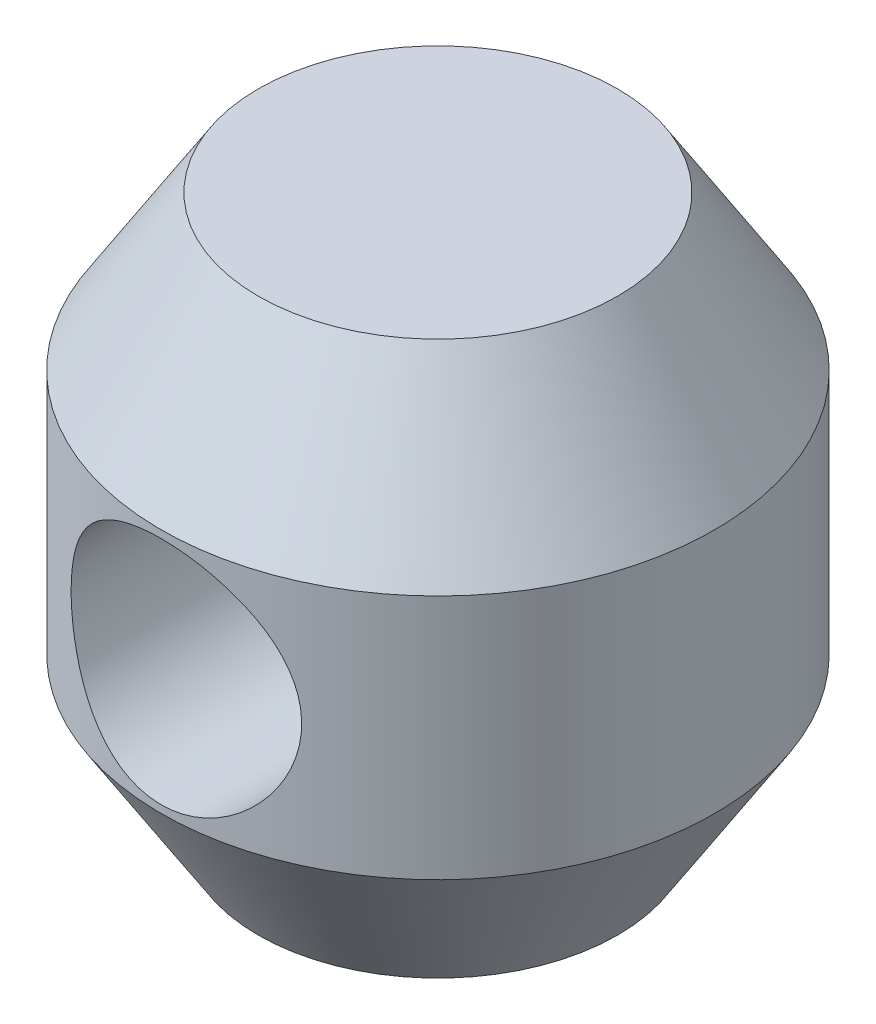
ISO-10303-21;
HEADER;
FILE_DESCRIPTION(('STEP AP214'),'2;1');
FILE_NAME('part.step','',(''),(''),'','','');
FILE_SCHEMA(('AUTOMOTIVE_DESIGN { 1 0 10303 214 1 1 1 1 }'));
ENDSEC;
DATA;
#1=APPLICATION_CONTEXT('core data for automotive mechanical design processes');
#2=APPLICATION_PROTOCOL_DEFINITION('international standard','automotive_design',2000,#1);
#3=PRODUCT_CONTEXT('',#1,'mechanical');
#4=PRODUCT('Part','Part','',(#3));
#5=PRODUCT_RELATED_PRODUCT_CATEGORY('part','',(#4));
#6=PRODUCT_DEFINITION_FORMATION('','',#4);
#7=PRODUCT_DEFINITION_CONTEXT('part definition',#1,'design');
#8=PRODUCT_DEFINITION('design','',#6,#7);
#9=PRODUCT_DEFINITION_SHAPE('','',#8);
#10=(LENGTH_UNIT() NAMED_UNIT(*) SI_UNIT(.MILLI.,.METRE.));
#11=(NAMED_UNIT(*) PLANE_ANGLE_UNIT() SI_UNIT($,.RADIAN.));
#12=(NAMED_UNIT(*) SI_UNIT($,.STERADIAN.) SOLID_ANGLE_UNIT());
#13=UNCERTAINTY_MEASURE_WITH_UNIT(LENGTH_MEASURE(1.E-05),#10,'distance_accuracy_value','');
#14=(GEOMETRIC_REPRESENTATION_CONTEXT(3) GLOBAL_UNCERTAINTY_ASSIGNED_CONTEXT((#13)) GLOBAL_UNIT_ASSIGNED_CONTEXT((#10,
#11,#12)) REPRESENTATION_CONTEXT('',''));
#15=CARTESIAN_POINT('',(0.,0.,0.));
#16=DIRECTION('',(0.,0.,1.));
#17=DIRECTION('',(1.,0.,0.));
#18=AXIS2_PLACEMENT_3D('',#15,#16,#17);
#19=CARTESIAN_POINT('',(6.18428062224485,9.525,0.));
#20=DIRECTION('',(0.,-1.,0.));
#21=DIRECTION('',(1.,0.,0.));
#22=AXIS2_PLACEMENT_3D('',#19,#20,#21);
#23=PLANE('',#22);
#24=CARTESIAN_POINT('',(0.,9.525,0.));
#25=DIRECTION('',(0.,1.,0.));
#26=DIRECTION('',(-1.,0.,0.));
#27=AXIS2_PLACEMENT_3D('',#24,#25,#26);
#28=CIRCLE('',#27,6.18428062224485);
#29=CARTESIAN_POINT('',(-6.18428062224484,9.525,0.));
#30=VERTEX_POINT('',#29);
#31=EDGE_CURVE('E45',#30,#30,#28,.T.);
#32=ORIENTED_EDGE('',*,*,#31,.T.);
#33=EDGE_LOOP('',(#32));
#34=FACE_BOUND('',#33,.T.);
#35=ADVANCED_FACE('F30',(#34),#23,.F.);
#36=CARTESIAN_POINT('',(0.,4.22956157153226,0.));
#37=DIRECTION('',(0.,-1.,0.));
#38=DIRECTION('',(1.,0.,0.));
#39=AXIS2_PLACEMENT_3D('',#36,#37,#38);
#40=CONICAL_SURFACE('',#39,9.525,0.562807434488238);
#41=ORIENTED_EDGE('',*,*,#31,.F.);
#42=EDGE_LOOP('',(#41));
#43=FACE_BOUND('',#42,.T.);
#44=CARTESIAN_POINT('',(0.,4.22956157153226,0.));
#45=DIRECTION('',(0.,1.,0.));
#46=DIRECTION('',(-1.,0.,0.));
#47=AXIS2_PLACEMENT_3D('',#44,#45,#46);
#48=CIRCLE('',#47,9.525);
#49=CARTESIAN_POINT('',(-9.52499999999999,4.22956157153226,0.));
#50=VERTEX_POINT('',#49);
#51=EDGE_CURVE('E49',#50,#50,#48,.T.);
#52=ORIENTED_EDGE('',*,*,#51,.T.);
#53=EDGE_LOOP('',(#52));
#54=FACE_BOUND('',#53,.T.);
#55=ADVANCED_FACE('F73',(#43,#54),#40,.T.);
#56=CARTESIAN_POINT('',(0.,20.8294252873563,0.));
#57=DIRECTION('',(0.,1.,0.));
#58=DIRECTION('',(-1.,0.,0.));
#59=AXIS2_PLACEMENT_3D('',#56,#57,#58);
#60=CYLINDRICAL_SURFACE('',#59,9.525);
#61=CARTESIAN_POINT('',(0.,3.96875,9.525));
#62=CARTESIAN_POINT('',(0.106339704110794,3.96874924420082,9.52499940431025));
#63=CARTESIAN_POINT('',(0.212715681361913,3.96447001336336,9.52321418687749));
#64=CARTESIAN_POINT('',(0.42470860687925,3.94739427644123,9.51611852971386));
#65=CARTESIAN_POINT('',(0.530325032060802,3.93459238067755,9.51080585924981));
#66=CARTESIAN_POINT('',(0.740196085308894,3.9005644371029,9.49677884054498));
#67=CARTESIAN_POINT('',(0.844447466681663,3.8793211215613,9.48805752018965));
#68=CARTESIAN_POINT('',(1.05063078746721,3.82863481224293,9.4674477074533));
#69=CARTESIAN_POINT('',(1.15256176045452,3.79918846721341,9.45555792071835));
#70=CARTESIAN_POINT('',(1.453048561021,3.69918624362517,9.41566954873609));
#71=CARTESIAN_POINT('',(1.64725042578753,3.61681028624573,9.38338421186794));
#72=CARTESIAN_POINT('',(2.01878960760282,3.4233641905776,9.31053593336085));
#73=CARTESIAN_POINT('',(2.19613201080231,3.31230274392849,9.2699754998386));
#74=CARTESIAN_POINT('',(2.53824093920423,3.05870239023164,9.18234884286995));
#75=CARTESIAN_POINT('',(2.70205730367417,2.91495316865578,9.135069524208));
#76=CARTESIAN_POINT('',(3.00405615198818,2.60267091834204,9.04026456603982));
#77=CARTESIAN_POINT('',(3.14222513903648,2.43412492359048,8.99273881029333));
#78=CARTESIAN_POINT('',(3.39579467666476,2.06679786086128,8.90018838067789));
#79=CARTESIAN_POINT('',(3.50974047292495,1.86693718272473,8.85540182052122));
#80=CARTESIAN_POINT('',(3.65386256626164,1.55355911222668,8.79645372122562));
#81=CARTESIAN_POINT('',(3.69744892615389,1.44679096419393,8.7781707903278));
#82=CARTESIAN_POINT('',(3.77528941119493,1.22941680377217,8.74497623698358));
#83=CARTESIAN_POINT('',(3.80954833407463,1.11881279755699,8.73006288201086));
#84=CARTESIAN_POINT('',(3.86694170240058,0.899958333449474,8.70478736192303));
#85=CARTESIAN_POINT('',(3.89052895323577,0.791847389406897,8.69424199074779));
#86=CARTESIAN_POINT('',(3.92861373354644,0.573771115071428,8.6770995707797));
#87=CARTESIAN_POINT('',(3.94311546377091,0.463806665945378,8.67050069736238));
#88=CARTESIAN_POINT('',(3.9628609387512,0.242906411230518,8.66149391151971));
#89=CARTESIAN_POINT('',(3.96810707162349,0.131970863629311,8.65908491802959));
#90=CARTESIAN_POINT('',(3.96928172781075,-0.089955430575609,8.65854653232212));
#91=CARTESIAN_POINT('',(3.96521074158956,-0.200946173966251,8.66041691483349));
#92=CARTESIAN_POINT('',(3.94847322291751,-0.413533747050387,8.66805984388474));
#93=CARTESIAN_POINT('',(3.9364922679005,-0.515196191446447,8.67352102353331));
#94=CARTESIAN_POINT('',(3.90477208316463,-0.717069866389166,8.68784624326787));
#95=CARTESIAN_POINT('',(3.8850303162509,-0.817280611220548,8.696711396172));
#96=CARTESIAN_POINT('',(3.81443477338007,-1.11466693937906,8.72802607625492));
#97=CARTESIAN_POINT('',(3.75219655480152,-1.30877252533342,8.75520186013043));
#98=CARTESIAN_POINT('',(3.59796791715169,-1.68772720033092,8.8197115743198));
#99=CARTESIAN_POINT('',(3.50537257326443,-1.87229142439091,8.85724935772168));
#100=CARTESIAN_POINT('',(3.29346810049255,-2.22400833873649,8.93820695787082));
#101=CARTESIAN_POINT('',(3.17414843672174,-2.39115412439081,8.98162909159069));
#102=CARTESIAN_POINT('',(2.90034934429311,-2.71811992170749,9.07392703271809));
#103=CARTESIAN_POINT('',(2.74375071631134,-2.87612703603657,9.12295360910874));
#104=CARTESIAN_POINT('',(2.40579154448283,-3.16424718714745,9.21784011680501));
#105=CARTESIAN_POINT('',(2.22442521639881,-3.29435368973569,9.26369930462192));
#106=CARTESIAN_POINT('',(1.836572211371,-3.52563392964764,9.34841550416938));
#107=CARTESIAN_POINT('',(1.62960234239377,-3.62607053905012,9.38708646308532));
#108=CARTESIAN_POINT('',(1.19968138489649,-3.79006456757172,9.4516410345857));
#109=CARTESIAN_POINT('',(0.976739205259839,-3.85364236825926,9.4775317130173));
#110=CARTESIAN_POINT('',(0.536346758201585,-3.93832078733203,9.51228860774907));
#111=CARTESIAN_POINT('',(0.31944083031238,-3.96185345068164,9.52212792826798));
#112=CARTESIAN_POINT('',(-0.115426030752923,-3.97302425667796,9.52677959918587));
#113=CARTESIAN_POINT('',(-0.333386643092941,-3.96067270468772,9.52159626384832));
#114=CARTESIAN_POINT('',(-0.752786919544955,-3.90216680656032,9.4974161606133));
#115=CARTESIAN_POINT('',(-0.954509669108738,-3.85772039596071,9.47911767126829));
#116=CARTESIAN_POINT('',(-1.34741522795454,-3.73866348211368,9.43129326502252));
#117=CARTESIAN_POINT('',(-1.53859670219198,-3.6640491680502,9.40176592971953));
#118=CARTESIAN_POINT('',(-1.91169607458845,-3.48433715217341,9.33317509298508));
#119=CARTESIAN_POINT('',(-2.09314172700116,-3.37836451851939,9.29384385415235));
#120=CARTESIAN_POINT('',(-2.4363242365493,-3.13990552550332,9.20984329538343));
#121=CARTESIAN_POINT('',(-2.59805281957314,-3.00740809642179,9.16517174989765));
#122=CARTESIAN_POINT('',(-2.9093586410544,-2.70858223433092,9.07135879069043));
#123=CARTESIAN_POINT('',(-3.05724146582755,-2.54051275288848,9.02212608805476));
#124=CARTESIAN_POINT('',(-3.32317676164349,-2.18115744903529,8.92760269234454));
#125=CARTESIAN_POINT('',(-3.44122245828603,-1.98986636882128,8.88231289601851));
#126=CARTESIAN_POINT('',(-3.64540673564476,-1.58554999291578,8.80050901339688));
#127=CARTESIAN_POINT('',(-3.73106690034735,-1.37225393536598,8.76412911168937));
#128=CARTESIAN_POINT('',(-3.86452789664724,-0.93227336652579,8.70611529160775));
#129=CARTESIAN_POINT('',(-3.91235994567536,-0.705600061106086,8.68446921628955));
#130=CARTESIAN_POINT('',(-3.96570453838301,-0.264100623589908,8.66023047600161));
#131=CARTESIAN_POINT('',(-3.97419128243223,-0.0497056739995989,8.65629940020153));
#132=CARTESIAN_POINT('',(-3.95654456856183,0.377326060905224,8.66437982610695));
#133=CARTESIAN_POINT('',(-3.93041642538565,0.58996311108262,8.67638888037756));
#134=CARTESIAN_POINT('',(-3.84677918968913,0.9972445556043,8.71377327866252));
#135=CARTESIAN_POINT('',(-3.79078759664359,1.19226573903112,8.73850035697025));
#136=CARTESIAN_POINT('',(-3.65049901233461,1.57018966693979,8.79802591245426));
#137=CARTESIAN_POINT('',(-3.56619406749029,1.75308898893121,8.83282721922988));
#138=CARTESIAN_POINT('',(-3.36582424000277,2.11358565826455,8.9111761652871));
#139=CARTESIAN_POINT('',(-3.2481544891375,2.2902029575896,8.95512388439338));
#140=CARTESIAN_POINT('',(-2.98668090348688,2.62210138158152,9.04569075374842));
#141=CARTESIAN_POINT('',(-2.84286800697564,2.7773750752612,9.09231082643891));
#142=CARTESIAN_POINT('',(-2.52060299354102,3.07389036395109,9.18707098471588));
#143=CARTESIAN_POINT('',(-2.34039087540218,3.2132862888568,9.23507447466898));
#144=CARTESIAN_POINT('',(-2.05338852131443,3.39817492049314,9.30155622819451));
#145=CARTESIAN_POINT('',(-1.95485248361422,3.45580765382273,9.32281142897057));
#146=CARTESIAN_POINT('',(-1.75280765547819,3.56253706293522,9.36289852055438));
#147=CARTESIAN_POINT('',(-1.64930118613717,3.61163767451637,9.38173152765292));
#148=CARTESIAN_POINT('',(-1.43970220933928,3.70013143117591,9.41615560801286));
#149=CARTESIAN_POINT('',(-1.33367770464092,3.73966750311788,9.43179378843126));
#150=CARTESIAN_POINT('',(-1.11828343863684,3.80962337808588,9.4597489373536));
#151=CARTESIAN_POINT('',(-1.00891529125309,3.8400475050626,9.47206748086748));
#152=CARTESIAN_POINT('',(-0.787917389017953,3.89140117159789,9.49300284455447));
#153=CARTESIAN_POINT('',(-0.676293942040774,3.91235415864672,9.50162880353855));
#154=CARTESIAN_POINT('',(-0.451486990346156,3.94461831406101,9.51495896057856));
#155=CARTESIAN_POINT('',(-0.338304692950853,3.9559365599505,9.51966603732563));
#156=CARTESIAN_POINT('',(-0.187413035354005,3.96450008063218,9.52322990511201));
#157=CARTESIAN_POINT('',(-0.149952710192013,3.96609336524366,9.52389333055183));
#158=CARTESIAN_POINT('',(-0.0749964270699425,3.96821845971287,9.5247784836626));
#159=CARTESIAN_POINT('',(-0.0375004690081324,3.96875026653096,9.52500021006871));
#160=CARTESIAN_POINT('',(0.,3.96875,9.525));
#161=B_SPLINE_CURVE_WITH_KNOTS('',3,(#61,#62,#63,#64,#65,#66,#67,#68,#69,#70,#71,#72,#73,#74,
#75,#76,#77,#78,#79,#80,#81,#82,#83,#84,#85,#86,#87,#88,#89,#90,#91,#92,#93,#94,#95,#96,#97,#98,
#99,#100,#101,#102,#103,#104,#105,#106,#107,#108,#109,#110,#111,#112,#113,#114,#115,#116,#117,
#118,#119,#120,#121,#122,#123,#124,#125,#126,#127,#128,#129,#130,#131,#132,#133,#134,#135,#136,
#137,#138,#139,#140,#141,#142,#143,#144,#145,#146,#147,#148,#149,#150,#151,#152,#153,#154,#155,
#156,#157,#158,#159,#160),.UNSPECIFIED.,.T.,.F.,(4,2,2,2,2,2,2,2,2,2,2,2,2,2,2,2,2,2,2,2,2,2,2,
2,2,2,2,2,2,2,2,2,2,2,2,2,2,2,2,2,2,2,2,2,2,2,2,2,2,4),(0.,0.318980749509823,0.638163412276113,
0.958002382820618,1.27797221198539,1.91504647529178,2.55192793249747,3.2180268226589,
3.8844752561633,4.58371459960651,4.93360722716025,5.28331953982213,5.61634537556026,
5.94921712080441,6.28200296637182,6.61477129411297,6.92193148931368,7.22919218614458,
7.8431902763468,8.47025383462199,9.09756502152911,9.77789117581852,10.458376485746,
11.1545684431886,11.8503750639387,12.5021777727435,13.153793312916,13.773071419117,
14.3924277771145,15.0310237398989,15.6698867686643,16.3544066899379,17.0390818893887,
17.7335092254227,18.4273628896257,19.0678058075265,19.7081504037046,20.318685081389,
20.9293914096898,21.5768183103766,22.2244700512815,22.919292181413,23.2672758934176,
23.6150986547657,23.9573486775529,24.2994360319326,24.6406717865073,24.9816566580067,
25.0941442143458,25.206632092803),.UNSPECIFIED.);
#162=CARTESIAN_POINT('',(0.,3.96875,9.525));
#163=VERTEX_POINT('',#162);
#164=EDGE_CURVE('E10',#163,#163,#161,.T.);
#165=ORIENTED_EDGE('',*,*,#164,.T.);
#166=EDGE_LOOP('',(#165));
#167=FACE_BOUND('',#166,.T.);
#168=CARTESIAN_POINT('',(-3.96875,0.,-8.65879024099209));
#169=CARTESIAN_POINT('',(-3.96874923668716,-0.105887379078517,-8.6587910205729));
#170=CARTESIAN_POINT('',(-3.96450596322607,-0.211812673428365,-8.66073940768989));
#171=CARTESIAN_POINT('',(-3.94757702512668,-0.422891233699202,-8.66846838683714));
#172=CARTESIAN_POINT('',(-3.93488584908344,-0.528043950282211,-8.67425148061748));
#173=CARTESIAN_POINT('',(-3.90116132046328,-0.736974242260081,-8.68947118368981));
#174=CARTESIAN_POINT('',(-3.88011024226912,-0.840748408377878,-8.69891555501984));
#175=CARTESIAN_POINT('',(-3.82989753813636,-1.04596468391146,-8.72113840649931));
#176=CARTESIAN_POINT('',(-3.800732499549,-1.14740579258846,-8.73391828939057));
#177=CARTESIAN_POINT('',(-3.70176138527685,-1.44629317193216,-8.77654753619217));
#178=CARTESIAN_POINT('',(-3.62029961529032,-1.63939720290292,-8.81077287774565));
#179=CARTESIAN_POINT('',(-3.42901239871784,-2.0090416871063,-8.88695862138102));
#180=CARTESIAN_POINT('',(-3.31919366167758,-2.18558604507273,-8.92891719303104));
#181=CARTESIAN_POINT('',(-3.06696935632263,-2.52832534169636,-9.01876991033428));
#182=CARTESIAN_POINT('',(-2.92307464281136,-2.6933741279096,-9.06686538814375));
#183=CARTESIAN_POINT('',(-2.60991820868105,-2.99783807844458,-9.16191652649437));
#184=CARTESIAN_POINT('',(-2.44064675297659,-3.13724335943846,-9.20887174153744));
#185=CARTESIAN_POINT('',(-2.07252394969182,-3.39232658444351,-9.29879828699088));
#186=CARTESIAN_POINT('',(-1.87270805407861,-3.50671311320483,-9.34150848290225));
#187=CARTESIAN_POINT('',(-1.45456912438822,-3.6997515458228,-9.41566952109946));
#188=CARTESIAN_POINT('',(-1.23625435704163,-3.77841931269852,-9.44712536022648));
#189=CARTESIAN_POINT('',(-0.799364992773574,-3.89362773679741,-9.49380629029461));
#190=CARTESIAN_POINT('',(-0.581395132508637,-3.93214761934919,-9.50979083254831));
#191=CARTESIAN_POINT('',(-0.141538894574073,-3.9723620226425,-9.52648680915417));
#192=CARTESIAN_POINT('',(0.08034585790483,-3.9740714805396,-9.52720443860461));
#193=CARTESIAN_POINT('',(0.507342076103745,-3.94165365511486,-9.51373284979151));
#194=CARTESIAN_POINT('',(0.712652526126103,-3.90970103004757,-9.50044819004534));
#195=CARTESIAN_POINT('',(1.1146881884345,-3.81459389990714,-9.46170690687204));
#196=CARTESIAN_POINT('',(1.31141276665414,-3.75143709463528,-9.43624938613372));
#197=CARTESIAN_POINT('',(1.69430102484052,-3.59496346994524,-9.37513531412926));
#198=CARTESIAN_POINT('',(1.880257787197,-3.50120120532889,-9.33932908373936));
#199=CARTESIAN_POINT('',(2.23428486113606,-3.28661472253269,-9.26102141919015));
#200=CARTESIAN_POINT('',(2.40234882038608,-3.16578094032786,-9.21851762044279));
#201=CARTESIAN_POINT('',(2.72840739466443,-2.8905758152039,-9.12754393612972));
#202=CARTESIAN_POINT('',(2.88485718846313,-2.73444083770626,-9.0788646956454));
#203=CARTESIAN_POINT('',(3.17001974241128,-2.3980411757395,-8.98327707679464));
#204=CARTESIAN_POINT('',(3.2987217992977,-2.2177672233427,-8.93636938751097));
#205=CARTESIAN_POINT('',(3.52870100864073,-1.83072075866658,-8.84814119166935));
#206=CARTESIAN_POINT('',(3.62893779383696,-1.62327207205202,-8.80705498186068));
#207=CARTESIAN_POINT('',(3.79242421765044,-1.19227268250243,-8.7379125517104));
#208=CARTESIAN_POINT('',(3.85570030311341,-0.968733621831397,-8.70984701752511));
#209=CARTESIAN_POINT('',(3.93954079913443,-0.527377631636019,-8.67223349806231));
#210=CARTESIAN_POINT('',(3.96261001460595,-0.310130436810913,-8.66160222215845));
#211=CARTESIAN_POINT('',(3.97273876896575,0.125344181639912,-8.65696410608794));
#212=CARTESIAN_POINT('',(3.95981076584797,0.343571240054288,-8.66295151448942));
#213=CARTESIAN_POINT('',(3.90059791270946,0.760089873745779,-8.68975692026399));
#214=CARTESIAN_POINT('',(3.85650164747395,0.95876328054947,-8.70960088203742));
#215=CARTESIAN_POINT('',(3.73910410941324,1.34572786637936,-8.76063876193411));
#216=CARTESIAN_POINT('',(3.6657960101861,1.5340166069361,-8.79183533285731));
#217=CARTESIAN_POINT('',(3.48861128556531,1.90377861038325,-8.86367283196266));
#218=CARTESIAN_POINT('',(3.38357156997338,2.08462554439224,-8.90465777492367));
#219=CARTESIAN_POINT('',(3.14706249042386,2.42699556667992,-8.99096511876898));
#220=CARTESIAN_POINT('',(3.0155816875005,2.58851024301202,-9.03628939247655));
#221=CARTESIAN_POINT('',(2.71730614690296,2.90131542827446,-9.13062117816102));
#222=CARTESIAN_POINT('',(2.54850792522224,3.05070319491197,-9.17962815801311));
#223=CARTESIAN_POINT('',(2.18710355233342,3.31937452696573,-9.27237671758216));
#224=CARTESIAN_POINT('',(1.99449565786156,3.43865588614543,-9.3161179112927));
#225=CARTESIAN_POINT('',(1.58957861164103,3.64359785479083,-9.39368998787192));
#226=CARTESIAN_POINT('',(1.37722028893965,3.72917161705633,-9.4274952147606));
#227=CARTESIAN_POINT('',(0.939351801278083,3.86275831470016,-9.48112699592905));
#228=CARTESIAN_POINT('',(0.713849549656811,3.91079360427944,-9.50096186887384));
#229=CARTESIAN_POINT('',(0.273102495053092,3.96512455186448,-9.52346123017774));
#230=CARTESIAN_POINT('',(0.0582424734462807,3.97410306108938,-9.52722899525003));
#231=CARTESIAN_POINT('',(-0.369845631417771,3.95727826434234,-9.52022236923208));
#232=CARTESIAN_POINT('',(-0.583073994171518,3.93148105580209,-9.50945052745643));
#233=CARTESIAN_POINT('',(-0.994049566605753,3.84776326416207,-9.47515459954545));
#234=CARTESIAN_POINT('',(-1.19207762697848,3.79101467329316,-9.45209643561816));
#235=CARTESIAN_POINT('',(-1.57572788752717,3.64828360629685,-9.39576160316586));
#236=CARTESIAN_POINT('',(-1.76134772306674,3.56229557690418,-9.36248299365131));
#237=CARTESIAN_POINT('',(-2.12415277842681,3.35918386353498,-9.28706002256017));
#238=CARTESIAN_POINT('',(-2.30057768742397,3.24082867557986,-9.24458295628571));
#239=CARTESIAN_POINT('',(-2.63181762211253,2.97812483590401,-9.15579683737068));
#240=CARTESIAN_POINT('',(-2.7866245874936,2.83376653454478,-9.10948636563035));
#241=CARTESIAN_POINT('',(-3.08117477278758,2.51160959424722,-9.01429734364253));
#242=CARTESIAN_POINT('',(-3.21917615513278,2.3322038850505,-8.96545847678224));
#243=CARTESIAN_POINT('',(-3.46340851994891,1.95113222227045,-8.87397991555298));
#244=CARTESIAN_POINT('',(-3.56962174233661,1.74945391077242,-8.83134369341947));
#245=CARTESIAN_POINT('',(-3.70200982450633,1.43492580328635,-8.77627475250713));
#246=CARTESIAN_POINT('',(-3.74159595935619,1.32831563503482,-8.75942523874242));
#247=CARTESIAN_POINT('',(-3.81157741157257,1.11165942672225,-8.72920169496158));
#248=CARTESIAN_POINT('',(-3.84197723421212,1.00161510019809,-8.71582596174185));
#249=CARTESIAN_POINT('',(-3.89316985287221,0.779229036314698,-8.69307979206403));
#250=CARTESIAN_POINT('',(-3.91398801403936,0.666894196497894,-8.6836987855147));
#251=CARTESIAN_POINT('',(-3.94586543312834,0.440630098134531,-8.6692607254691));
#252=CARTESIAN_POINT('',(-3.95693228118173,0.326702149914922,-8.66420030904954));
#253=CARTESIAN_POINT('',(-3.96495416384753,0.177123827809531,-8.66052913078492));
#254=CARTESIAN_POINT('',(-3.9663771927552,0.141718687470541,-8.65987747760913));
#255=CARTESIAN_POINT('',(-3.96827524293176,0.070877114099467,-8.65900790025478));
#256=CARTESIAN_POINT('',(-3.96875025548207,0.0354406807825913,-8.65878998006511));
#257=CARTESIAN_POINT('',(-3.96875,0.,-8.65879024099209));
#258=B_SPLINE_CURVE_WITH_KNOTS('',3,(#168,#169,#170,#171,#172,#173,#174,#175,#176,#177,#178,
#179,#180,#181,#182,#183,#184,#185,#186,#187,#188,#189,#190,#191,#192,#193,#194,#195,#196,#197,
#198,#199,#200,#201,#202,#203,#204,#205,#206,#207,#208,#209,#210,#211,#212,#213,#214,#215,#216,
#217,#218,#219,#220,#221,#222,#223,#224,#225,#226,#227,#228,#229,#230,#231,#232,#233,#234,#235,
#236,#237,#238,#239,#240,#241,#242,#243,#244,#245,#246,#247,#248,#249,#250,#251,#252,#253,#254,
#255,#256,#257),.UNSPECIFIED.,.T.,.F.,(4,2,2,2,2,2,2,2,2,2,2,2,2,2,2,2,2,2,2,2,2,2,2,2,2,2,2,2,
2,2,2,2,2,2,2,2,2,2,2,2,2,2,2,2,4),(0.,0.317624964825135,0.635457351283367,0.953967271395805,
1.27261135657331,1.90660643830736,2.54045164762097,3.21006383314766,3.87993355732656,
4.57885824907349,5.2774722378272,5.93973085752439,6.6017207368687,7.22342254550611,
7.84517018938421,8.47640373254649,9.10786063518827,9.78382800378678,10.4600556517378,
11.1585081926939,11.8564603490112,12.5091288290646,13.1615714603001,13.7722429766909,
14.3830572823439,15.0197393943162,15.6566975430954,16.3455094096919,17.0343717386686,
17.7249974819295,18.4152116427548,19.0571807820756,19.6990373758001,20.3181250452478,
20.9373303599108,21.5845197626613,22.2319498311421,22.923435172187,23.6153061288041,
23.9598103813919,24.3041454023967,24.647563560693,24.9907141757927,25.0970227987928,
25.2033323994733),.UNSPECIFIED.);
#259=CARTESIAN_POINT('',(-3.96875,0.,-8.65879024099209));
#260=VERTEX_POINT('',#259);
#261=EDGE_CURVE('E41',#260,#260,#258,.T.);
#262=ORIENTED_EDGE('',*,*,#261,.T.);
#263=EDGE_LOOP('',(#262));
#264=FACE_BOUND('',#263,.T.);
#265=ORIENTED_EDGE('',*,*,#51,.F.);
#266=EDGE_LOOP('',(#265));
#267=FACE_BOUND('',#266,.T.);
#268=CARTESIAN_POINT('',(0.,-4.22956157153227,0.));
#269=DIRECTION('',(0.,1.,0.));
#270=DIRECTION('',(-1.,0.,0.));
#271=AXIS2_PLACEMENT_3D('',#268,#269,#270);
#272=CIRCLE('',#271,9.525);
#273=CARTESIAN_POINT('',(-9.52499999999999,-4.22956157153227,0.));
#274=VERTEX_POINT('',#273);
#275=EDGE_CURVE('E87',#274,#274,#272,.T.);
#276=ORIENTED_EDGE('',*,*,#275,.T.);
#277=EDGE_LOOP('',(#276));
#278=FACE_BOUND('',#277,.T.);
#279=ADVANCED_FACE('F55',(#167,#264,#267,#278),#60,.T.);
#280=CARTESIAN_POINT('',(0.,-9.525,0.));
#281=DIRECTION('',(0.,1.,0.));
#282=DIRECTION('',(-1.,0.,0.));
#283=AXIS2_PLACEMENT_3D('',#280,#281,#282);
#284=CONICAL_SURFACE('',#283,6.18428062224484,0.562807434488238);
#285=ORIENTED_EDGE('',*,*,#275,.F.);
#286=EDGE_LOOP('',(#285));
#287=FACE_BOUND('',#286,.T.);
#288=CARTESIAN_POINT('',(0.,-9.525,0.));
#289=DIRECTION('',(0.,1.,0.));
#290=DIRECTION('',(-1.,0.,0.));
#291=AXIS2_PLACEMENT_3D('',#288,#289,#290);
#292=CIRCLE('',#291,6.18428062224484);
#293=CARTESIAN_POINT('',(-6.18428062224484,-9.525,0.));
#294=VERTEX_POINT('',#293);
#295=EDGE_CURVE('E89',#294,#294,#292,.T.);
#296=ORIENTED_EDGE('',*,*,#295,.T.);
#297=EDGE_LOOP('',(#296));
#298=FACE_BOUND('',#297,.T.);
#299=ADVANCED_FACE('F66',(#287,#298),#284,.T.);
#300=CARTESIAN_POINT('',(6.18428062224485,-9.525,0.));
#301=DIRECTION('',(0.,1.,0.));
#302=DIRECTION('',(-1.,0.,0.));
#303=AXIS2_PLACEMENT_3D('',#300,#301,#302);
#304=PLANE('',#303);
#305=ORIENTED_EDGE('',*,*,#295,.F.);
#306=EDGE_LOOP('',(#305));
#307=FACE_BOUND('',#306,.T.);
#308=ADVANCED_FACE('F62',(#307),#304,.F.);
#309=CARTESIAN_POINT('',(0.,0.,9.525));
#310=DIRECTION('',(0.,0.,-1.));
#311=DIRECTION('',(-1.,0.,0.));
#312=AXIS2_PLACEMENT_3D('',#309,#310,#311);
#313=CYLINDRICAL_SURFACE('',#312,3.96875);
#314=ORIENTED_EDGE('',*,*,#261,.F.);
#315=EDGE_LOOP('',(#314));
#316=FACE_BOUND('',#315,.T.);
#317=ORIENTED_EDGE('',*,*,#164,.F.);
#318=EDGE_LOOP('',(#317));
#319=FACE_BOUND('',#318,.T.);
#320=ADVANCED_FACE('F58',(#316,#319),#313,.F.);
#321=CLOSED_SHELL('',(#35,#55,#279,#299,#308,#320));
#322=MANIFOLD_SOLID_BREP('B2',#321);
#323=ADVANCED_BREP_SHAPE_REPRESENTATION('',(#18,#322),#14);
#324=SHAPE_DEFINITION_REPRESENTATION(#9,#323);
ENDSEC;
END-ISO-10303-21;
